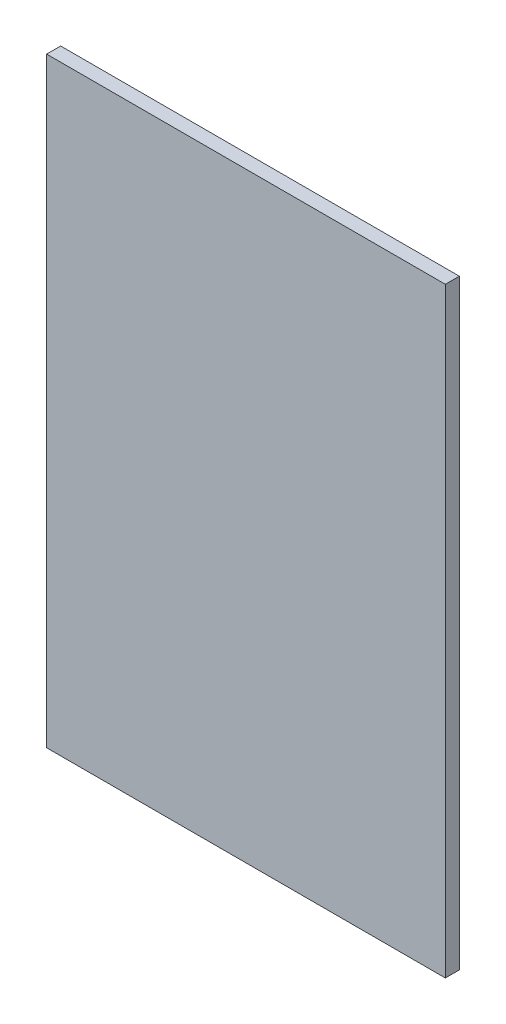
ISO-10303-21;
HEADER;
FILE_DESCRIPTION(('STEP AP214'),'2;1');
FILE_NAME('part.step','',(''),(''),'','','');
FILE_SCHEMA(('AUTOMOTIVE_DESIGN { 1 0 10303 214 1 1 1 1 }'));
ENDSEC;
DATA;
#1=APPLICATION_CONTEXT('core data for automotive mechanical design processes');
#2=APPLICATION_PROTOCOL_DEFINITION('international standard','automotive_design',2000,#1);
#3=PRODUCT_CONTEXT('',#1,'mechanical');
#4=PRODUCT('Part','Part','',(#3));
#5=PRODUCT_RELATED_PRODUCT_CATEGORY('part','',(#4));
#6=PRODUCT_DEFINITION_FORMATION('','',#4);
#7=PRODUCT_DEFINITION_CONTEXT('part definition',#1,'design');
#8=PRODUCT_DEFINITION('design','',#6,#7);
#9=PRODUCT_DEFINITION_SHAPE('','',#8);
#10=(LENGTH_UNIT() NAMED_UNIT(*) SI_UNIT(.MILLI.,.METRE.));
#11=(NAMED_UNIT(*) PLANE_ANGLE_UNIT() SI_UNIT($,.RADIAN.));
#12=(NAMED_UNIT(*) SI_UNIT($,.STERADIAN.) SOLID_ANGLE_UNIT());
#13=UNCERTAINTY_MEASURE_WITH_UNIT(LENGTH_MEASURE(1.E-05),#10,'distance_accuracy_value','');
#14=(GEOMETRIC_REPRESENTATION_CONTEXT(3) GLOBAL_UNCERTAINTY_ASSIGNED_CONTEXT((#13)) GLOBAL_UNIT_ASSIGNED_CONTEXT((#10,
#11,#12)) REPRESENTATION_CONTEXT('',''));
#15=CARTESIAN_POINT('',(0.,0.,0.));
#16=DIRECTION('',(0.,0.,1.));
#17=DIRECTION('',(1.,0.,0.));
#18=AXIS2_PLACEMENT_3D('',#15,#16,#17);
#19=CARTESIAN_POINT('',(4094.92034086121,-3342.17152109833,1.));
#20=DIRECTION('',(-1.,0.,0.));
#21=DIRECTION('',(0.,0.,1.));
#22=AXIS2_PLACEMENT_3D('',#19,#20,#21);
#23=PLANE('',#22);
#24=DIRECTION('',(0.,1.,0.));
#25=VECTOR('',#24,1.);
#26=CARTESIAN_POINT('',(4094.92034086121,-3342.17152109833,0.));
#27=LINE('',#26,#25);
#28=CARTESIAN_POINT('',(4094.92034086121,-3342.17152109833,0.));
#29=VERTEX_POINT('',#28);
#30=CARTESIAN_POINT('',(4094.92034086121,-3299.30152109833,0.));
#31=VERTEX_POINT('',#30);
#32=EDGE_CURVE('E100',#29,#31,#27,.T.);
#33=ORIENTED_EDGE('',*,*,#32,.T.);
#34=DIRECTION('',(0.,0.,-1.));
#35=VECTOR('',#34,1.);
#36=CARTESIAN_POINT('',(4094.92034086121,-3299.30152109833,1.));
#37=LINE('',#36,#35);
#38=CARTESIAN_POINT('',(4094.92034086121,-3299.30152109833,1.));
#39=VERTEX_POINT('',#38);
#40=EDGE_CURVE('E11',#39,#31,#37,.T.);
#41=ORIENTED_EDGE('',*,*,#40,.F.);
#42=DIRECTION('',(0.,1.,0.));
#43=VECTOR('',#42,1.);
#44=CARTESIAN_POINT('',(4094.92034086121,-3342.17152109833,1.));
#45=LINE('',#44,#43);
#46=CARTESIAN_POINT('',(4094.92034086121,-3342.17152109833,1.));
#47=VERTEX_POINT('',#46);
#48=EDGE_CURVE('E88',#47,#39,#45,.T.);
#49=ORIENTED_EDGE('',*,*,#48,.F.);
#50=DIRECTION('',(0.,0.,-1.));
#51=VECTOR('',#50,1.);
#52=CARTESIAN_POINT('',(4094.92034086121,-3342.17152109833,1.));
#53=LINE('',#52,#51);
#54=EDGE_CURVE('E96',#47,#29,#53,.T.);
#55=ORIENTED_EDGE('',*,*,#54,.T.);
#56=EDGE_LOOP('',(#33,#41,#49,#55));
#57=FACE_BOUND('',#56,.T.);
#58=ADVANCED_FACE('F37',(#57),#23,.F.);
#59=CARTESIAN_POINT('',(4066.47034086121,-3299.30152109833,1.));
#60=DIRECTION('',(0.,-1.,0.));
#61=DIRECTION('',(0.,0.,-1.));
#62=AXIS2_PLACEMENT_3D('',#59,#60,#61);
#63=PLANE('',#62);
#64=DIRECTION('',(-1.,0.,0.));
#65=VECTOR('',#64,1.);
#66=CARTESIAN_POINT('',(4066.47034086121,-3299.30152109833,0.));
#67=LINE('',#66,#65);
#68=CARTESIAN_POINT('',(4066.47034086121,-3299.30152109833,0.));
#69=VERTEX_POINT('',#68);
#70=EDGE_CURVE('E92',#31,#69,#67,.T.);
#71=ORIENTED_EDGE('',*,*,#70,.T.);
#72=DIRECTION('',(0.,0.,-1.));
#73=VECTOR('',#72,1.);
#74=CARTESIAN_POINT('',(4066.47034086121,-3299.30152109833,1.));
#75=LINE('',#74,#73);
#76=CARTESIAN_POINT('',(4066.47034086121,-3299.30152109833,1.));
#77=VERTEX_POINT('',#76);
#78=EDGE_CURVE('E45',#77,#69,#75,.T.);
#79=ORIENTED_EDGE('',*,*,#78,.F.);
#80=DIRECTION('',(-1.,0.,0.));
#81=VECTOR('',#80,1.);
#82=CARTESIAN_POINT('',(4066.47034086121,-3299.30152109833,1.));
#83=LINE('',#82,#81);
#84=EDGE_CURVE('E83',#39,#77,#83,.T.);
#85=ORIENTED_EDGE('',*,*,#84,.F.);
#86=ORIENTED_EDGE('',*,*,#40,.T.);
#87=EDGE_LOOP('',(#71,#79,#85,#86));
#88=FACE_BOUND('',#87,.T.);
#89=ADVANCED_FACE('F91',(#88),#63,.F.);
#90=CARTESIAN_POINT('',(4066.47034086121,-3342.17152109833,1.));
#91=DIRECTION('',(1.,0.,0.));
#92=DIRECTION('',(0.,0.,-1.));
#93=AXIS2_PLACEMENT_3D('',#90,#91,#92);
#94=PLANE('',#93);
#95=DIRECTION('',(0.,-1.,0.));
#96=VECTOR('',#95,1.);
#97=CARTESIAN_POINT('',(4066.47034086121,-3342.17152109833,0.));
#98=LINE('',#97,#96);
#99=CARTESIAN_POINT('',(4066.47034086121,-3342.17152109833,0.));
#100=VERTEX_POINT('',#99);
#101=EDGE_CURVE('E70',#69,#100,#98,.T.);
#102=ORIENTED_EDGE('',*,*,#101,.T.);
#103=DIRECTION('',(0.,0.,-1.));
#104=VECTOR('',#103,1.);
#105=CARTESIAN_POINT('',(4066.47034086121,-3342.17152109833,1.));
#106=LINE('',#105,#104);
#107=CARTESIAN_POINT('',(4066.47034086121,-3342.17152109833,1.));
#108=VERTEX_POINT('',#107);
#109=EDGE_CURVE('E93',#108,#100,#106,.T.);
#110=ORIENTED_EDGE('',*,*,#109,.F.);
#111=DIRECTION('',(0.,-1.,0.));
#112=VECTOR('',#111,1.);
#113=CARTESIAN_POINT('',(4066.47034086121,-3342.17152109833,1.));
#114=LINE('',#113,#112);
#115=EDGE_CURVE('E86',#77,#108,#114,.T.);
#116=ORIENTED_EDGE('',*,*,#115,.F.);
#117=ORIENTED_EDGE('',*,*,#78,.T.);
#118=EDGE_LOOP('',(#102,#110,#116,#117));
#119=FACE_BOUND('',#118,.T.);
#120=ADVANCED_FACE('F94',(#119),#94,.F.);
#121=CARTESIAN_POINT('',(4066.47034086121,-3342.17152109833,1.));
#122=DIRECTION('',(0.,1.,0.));
#123=DIRECTION('',(0.,0.,1.));
#124=AXIS2_PLACEMENT_3D('',#121,#122,#123);
#125=PLANE('',#124);
#126=DIRECTION('',(1.,0.,0.));
#127=VECTOR('',#126,1.);
#128=CARTESIAN_POINT('',(4066.47034086121,-3342.17152109833,0.));
#129=LINE('',#128,#127);
#130=EDGE_CURVE('E76',#100,#29,#129,.T.);
#131=ORIENTED_EDGE('',*,*,#130,.T.);
#132=ORIENTED_EDGE('',*,*,#54,.F.);
#133=DIRECTION('',(1.,0.,0.));
#134=VECTOR('',#133,1.);
#135=CARTESIAN_POINT('',(4066.47034086121,-3342.17152109833,1.));
#136=LINE('',#135,#134);
#137=EDGE_CURVE('E53',#108,#47,#136,.T.);
#138=ORIENTED_EDGE('',*,*,#137,.F.);
#139=ORIENTED_EDGE('',*,*,#109,.T.);
#140=EDGE_LOOP('',(#131,#132,#138,#139));
#141=FACE_BOUND('',#140,.T.);
#142=ADVANCED_FACE('F107',(#141),#125,.F.);
#143=CARTESIAN_POINT('',(0.,0.,1.));
#144=DIRECTION('',(0.,0.,-1.));
#145=DIRECTION('',(-1.,0.,0.));
#146=AXIS2_PLACEMENT_3D('',#143,#144,#145);
#147=PLANE('',#146);
#148=ORIENTED_EDGE('',*,*,#48,.T.);
#149=ORIENTED_EDGE('',*,*,#84,.T.);
#150=ORIENTED_EDGE('',*,*,#115,.T.);
#151=ORIENTED_EDGE('',*,*,#137,.T.);
#152=EDGE_LOOP('',(#148,#149,#150,#151));
#153=FACE_BOUND('',#152,.T.);
#154=ADVANCED_FACE('F84',(#153),#147,.F.);
#155=CARTESIAN_POINT('',(0.,0.,0.));
#156=DIRECTION('',(0.,0.,-1.));
#157=DIRECTION('',(-1.,0.,0.));
#158=AXIS2_PLACEMENT_3D('',#155,#156,#157);
#159=PLANE('',#158);
#160=ORIENTED_EDGE('',*,*,#32,.F.);
#161=ORIENTED_EDGE('',*,*,#130,.F.);
#162=ORIENTED_EDGE('',*,*,#101,.F.);
#163=ORIENTED_EDGE('',*,*,#70,.F.);
#164=EDGE_LOOP('',(#160,#161,#162,#163));
#165=FACE_BOUND('',#164,.T.);
#166=ADVANCED_FACE('F110',(#165),#159,.T.);
#167=CLOSED_SHELL('',(#58,#89,#120,#142,#154,#166));
#168=MANIFOLD_SOLID_BREP('B2',#167);
#169=ADVANCED_BREP_SHAPE_REPRESENTATION('',(#18,#168),#14);
#170=SHAPE_DEFINITION_REPRESENTATION(#9,#169);
ENDSEC;
END-ISO-10303-21;
